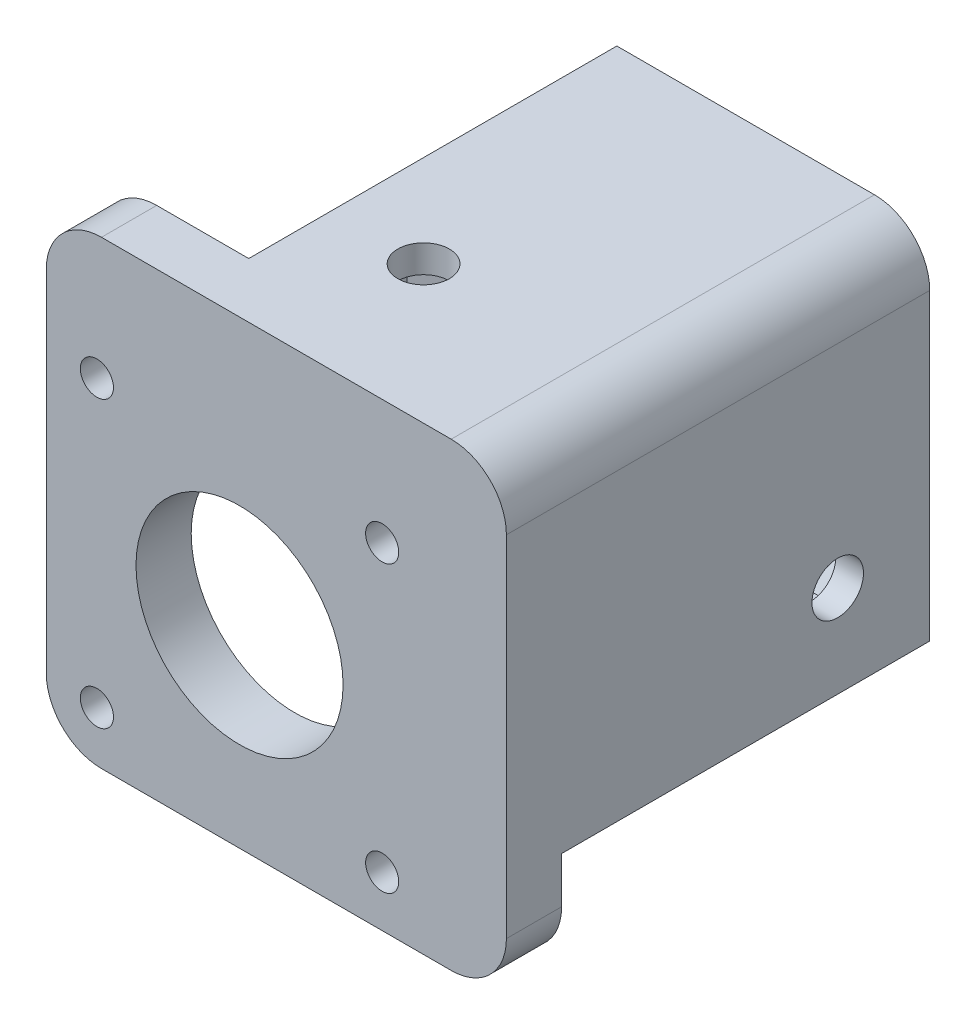
ISO-10303-21;
HEADER;
FILE_DESCRIPTION(('STEP AP214'),'2;1');
FILE_NAME('part.step','',(''),(''),'','','');
FILE_SCHEMA(('AUTOMOTIVE_DESIGN { 1 0 10303 214 1 1 1 1 }'));
ENDSEC;
DATA;
#1=APPLICATION_CONTEXT('core data for automotive mechanical design processes');
#2=APPLICATION_PROTOCOL_DEFINITION('international standard','automotive_design',2000,#1);
#3=PRODUCT_CONTEXT('',#1,'mechanical');
#4=PRODUCT('Part','Part','',(#3));
#5=PRODUCT_RELATED_PRODUCT_CATEGORY('part','',(#4));
#6=PRODUCT_DEFINITION_FORMATION('','',#4);
#7=PRODUCT_DEFINITION_CONTEXT('part definition',#1,'design');
#8=PRODUCT_DEFINITION('design','',#6,#7);
#9=PRODUCT_DEFINITION_SHAPE('','',#8);
#10=(LENGTH_UNIT() NAMED_UNIT(*) SI_UNIT(.MILLI.,.METRE.));
#11=(NAMED_UNIT(*) PLANE_ANGLE_UNIT() SI_UNIT($,.RADIAN.));
#12=(NAMED_UNIT(*) SI_UNIT($,.STERADIAN.) SOLID_ANGLE_UNIT());
#13=UNCERTAINTY_MEASURE_WITH_UNIT(LENGTH_MEASURE(1.E-05),#10,'distance_accuracy_value','');
#14=(GEOMETRIC_REPRESENTATION_CONTEXT(3) GLOBAL_UNCERTAINTY_ASSIGNED_CONTEXT((#13)) GLOBAL_UNIT_ASSIGNED_CONTEXT((#10,
#11,#12)) REPRESENTATION_CONTEXT('',''));
#15=CARTESIAN_POINT('',(0.,0.,0.));
#16=DIRECTION('',(0.,0.,1.));
#17=DIRECTION('',(1.,0.,0.));
#18=AXIS2_PLACEMENT_3D('',#15,#16,#17);
#19=CARTESIAN_POINT('',(0.,0.,0.));
#20=DIRECTION('',(0.,1.,0.));
#21=DIRECTION('',(0.,0.,1.));
#22=AXIS2_PLACEMENT_3D('',#19,#20,#21);
#23=PLANE('',#22);
#24=CARTESIAN_POINT('',(-24.,0.,-15.));
#25=DIRECTION('',(0.,1.,0.));
#26=DIRECTION('',(0.,0.,1.));
#27=AXIS2_PLACEMENT_3D('',#24,#25,#26);
#28=CIRCLE('',#27,2.79999999999999);
#29=CARTESIAN_POINT('',(-24.,0.,-12.2));
#30=VERTEX_POINT('',#29);
#31=EDGE_CURVE('E177',#30,#30,#28,.F.);
#32=ORIENTED_EDGE('',*,*,#31,.T.);
#33=EDGE_LOOP('',(#32));
#34=FACE_BOUND('',#33,.T.);
#35=DIRECTION('',(0.,0.,1.));
#36=VECTOR('',#35,1.);
#37=CARTESIAN_POINT('',(-44.,0.,-6.));
#38=LINE('',#37,#36);
#39=CARTESIAN_POINT('',(-44.,0.,0.));
#40=VERTEX_POINT('',#39);
#41=CARTESIAN_POINT('',(-44.,0.,-6.));
#42=VERTEX_POINT('',#41);
#43=EDGE_CURVE('E163',#40,#42,#38,.F.);
#44=ORIENTED_EDGE('',*,*,#43,.F.);
#45=DIRECTION('',(-1.,0.,0.));
#46=VECTOR('',#45,1.);
#47=CARTESIAN_POINT('',(0.,0.,0.));
#48=LINE('',#47,#46);
#49=CARTESIAN_POINT('',(-6.,0.,0.));
#50=VERTEX_POINT('',#49);
#51=EDGE_CURVE('E173',#50,#40,#48,.T.);
#52=ORIENTED_EDGE('',*,*,#51,.F.);
#53=DIRECTION('',(0.,0.,1.));
#54=VECTOR('',#53,1.);
#55=CARTESIAN_POINT('',(-6.,0.,-6.));
#56=LINE('',#55,#54);
#57=CARTESIAN_POINT('',(-6.,0.,-46.));
#58=VERTEX_POINT('',#57);
#59=EDGE_CURVE('E158',#58,#50,#56,.T.);
#60=ORIENTED_EDGE('',*,*,#59,.F.);
#61=DIRECTION('',(1.,0.,0.));
#62=VECTOR('',#61,1.);
#63=CARTESIAN_POINT('',(0.,0.,-46.));
#64=LINE('',#63,#62);
#65=CARTESIAN_POINT('',(-34.,0.,-46.));
#66=VERTEX_POINT('',#65);
#67=EDGE_CURVE('E168',#66,#58,#64,.T.);
#68=ORIENTED_EDGE('',*,*,#67,.F.);
#69=DIRECTION('',(0.,0.,1.));
#70=VECTOR('',#69,1.);
#71=CARTESIAN_POINT('',(-34.,0.,-46.));
#72=LINE('',#71,#70);
#73=CARTESIAN_POINT('',(-34.,0.,-6.));
#74=VERTEX_POINT('',#73);
#75=EDGE_CURVE('E185',#66,#74,#72,.T.);
#76=ORIENTED_EDGE('',*,*,#75,.T.);
#77=DIRECTION('',(-1.,0.,0.));
#78=VECTOR('',#77,1.);
#79=CARTESIAN_POINT('',(0.,0.,-6.));
#80=LINE('',#79,#78);
#81=EDGE_CURVE('E181',#74,#42,#80,.T.);
#82=ORIENTED_EDGE('',*,*,#81,.T.);
#83=EDGE_LOOP('',(#44,#52,#60,#68,#76,#82));
#84=FACE_BOUND('',#83,.T.);
#85=ADVANCED_FACE('F40',(#34,#84),#23,.T.);
#86=CARTESIAN_POINT('',(-3.,0.,0.));
#87=DIRECTION('',(-1.,0.,0.));
#88=DIRECTION('',(0.,0.,1.));
#89=AXIS2_PLACEMENT_3D('',#86,#87,#88);
#90=PLANE('',#89);
#91=DIRECTION('',(0.,0.866025403784439,-0.5));
#92=VECTOR('',#91,1.);
#93=CARTESIAN_POINT('',(-3.,-33.2,-38.4248711305964));
#94=LINE('',#93,#92);
#95=CARTESIAN_POINT('',(-3.,-33.2,-38.4248711305964));
#96=VERTEX_POINT('',#95);
#97=CARTESIAN_POINT('',(-3.,-29.,-40.8497422611929));
#98=VERTEX_POINT('',#97);
#99=EDGE_CURVE('E134',#96,#98,#94,.T.);
#100=ORIENTED_EDGE('',*,*,#99,.F.);
#101=DIRECTION('',(0.,0.,-1.));
#102=VECTOR('',#101,1.);
#103=CARTESIAN_POINT('',(-3.,-33.2,-33.5751288694036));
#104=LINE('',#103,#102);
#105=CARTESIAN_POINT('',(-3.,-33.2,-33.5751288694036));
#106=VERTEX_POINT('',#105);
#107=EDGE_CURVE('E88',#106,#96,#104,.T.);
#108=ORIENTED_EDGE('',*,*,#107,.F.);
#109=DIRECTION('',(0.,-0.866025403784438,-0.500000000000001));
#110=VECTOR('',#109,1.);
#111=CARTESIAN_POINT('',(-3.,-29.,-31.1502577388071));
#112=LINE('',#111,#110);
#113=CARTESIAN_POINT('',(-3.,-29.,-31.1502577388071));
#114=VERTEX_POINT('',#113);
#115=EDGE_CURVE('E82',#114,#106,#112,.T.);
#116=ORIENTED_EDGE('',*,*,#115,.F.);
#117=DIRECTION('',(0.,-0.866025403784439,0.5));
#118=VECTOR('',#117,1.);
#119=CARTESIAN_POINT('',(-3.,-24.8,-33.5751288694036));
#120=LINE('',#119,#118);
#121=CARTESIAN_POINT('',(-3.,-24.8,-33.5751288694036));
#122=VERTEX_POINT('',#121);
#123=EDGE_CURVE('E148',#122,#114,#120,.T.);
#124=ORIENTED_EDGE('',*,*,#123,.F.);
#125=DIRECTION('',(0.,0.,1.));
#126=VECTOR('',#125,1.);
#127=CARTESIAN_POINT('',(-3.,-24.8,-38.4248711305964));
#128=LINE('',#127,#126);
#129=CARTESIAN_POINT('',(-3.,-24.8,-38.4248711305964));
#130=VERTEX_POINT('',#129);
#131=EDGE_CURVE('E114',#130,#122,#128,.T.);
#132=ORIENTED_EDGE('',*,*,#131,.F.);
#133=DIRECTION('',(0.,0.866025403784438,0.500000000000001));
#134=VECTOR('',#133,1.);
#135=CARTESIAN_POINT('',(-3.,-29.,-40.8497422611929));
#136=LINE('',#135,#134);
#137=EDGE_CURVE('E142',#98,#130,#136,.T.);
#138=ORIENTED_EDGE('',*,*,#137,.F.);
#139=EDGE_LOOP('',(#100,#108,#116,#124,#132,#138));
#140=FACE_BOUND('',#139,.T.);
#141=CARTESIAN_POINT('',(-3.,-29.,-36.));
#142=DIRECTION('',(-1.,0.,0.));
#143=DIRECTION('',(0.,0.,1.));
#144=AXIS2_PLACEMENT_3D('',#141,#142,#143);
#145=CIRCLE('',#144,2.79999999999999);
#146=CARTESIAN_POINT('',(-3.,-29.,-33.2));
#147=VERTEX_POINT('',#146);
#148=EDGE_CURVE('E362',#147,#147,#145,.F.);
#149=ORIENTED_EDGE('',*,*,#148,.T.);
#150=EDGE_LOOP('',(#149));
#151=FACE_BOUND('',#150,.T.);
#152=ADVANCED_FACE('F603',(#140,#151),#90,.T.);
#153=CARTESIAN_POINT('',(-19.8,-3.,-17.4248711305964));
#154=DIRECTION('',(-0.500000000000001,0.,0.866025403784438));
#155=DIRECTION('',(0.866025403784438,0.,0.500000000000001));
#156=AXIS2_PLACEMENT_3D('',#153,#154,#155);
#157=PLANE('',#156);
#158=DIRECTION('',(-0.866025403784438,0.,-0.500000000000001));
#159=VECTOR('',#158,1.);
#160=CARTESIAN_POINT('',(-19.8,-6.,-17.4248711305964));
#161=LINE('',#160,#159);
#162=CARTESIAN_POINT('',(-19.8,-6.,-17.4248711305964));
#163=VERTEX_POINT('',#162);
#164=CARTESIAN_POINT('',(-24.,-6.,-19.8497422611929));
#165=VERTEX_POINT('',#164);
#166=EDGE_CURVE('E350',#163,#165,#161,.T.);
#167=ORIENTED_EDGE('',*,*,#166,.F.);
#168=DIRECTION('',(0.,-1.,0.));
#169=VECTOR('',#168,1.);
#170=CARTESIAN_POINT('',(-19.8,-3.,-17.4248711305964));
#171=LINE('',#170,#169);
#172=CARTESIAN_POINT('',(-19.8,-3.,-17.4248711305964));
#173=VERTEX_POINT('',#172);
#174=EDGE_CURVE('E321',#173,#163,#171,.T.);
#175=ORIENTED_EDGE('',*,*,#174,.F.);
#176=DIRECTION('',(-0.866025403784438,0.,-0.500000000000001));
#177=VECTOR('',#176,1.);
#178=CARTESIAN_POINT('',(-19.8,-3.,-17.4248711305964));
#179=LINE('',#178,#177);
#180=CARTESIAN_POINT('',(-24.,-3.,-19.8497422611929));
#181=VERTEX_POINT('',#180);
#182=EDGE_CURVE('E374',#173,#181,#179,.T.);
#183=ORIENTED_EDGE('',*,*,#182,.T.);
#184=DIRECTION('',(0.,-1.,0.));
#185=VECTOR('',#184,1.);
#186=CARTESIAN_POINT('',(-24.,-3.,-19.8497422611929));
#187=LINE('',#186,#185);
#188=EDGE_CURVE('E317',#181,#165,#187,.T.);
#189=ORIENTED_EDGE('',*,*,#188,.T.);
#190=EDGE_LOOP('',(#167,#175,#183,#189));
#191=FACE_BOUND('',#190,.T.);
#192=ADVANCED_FACE('F593',(#191),#157,.T.);
#193=CARTESIAN_POINT('',(-19.8,-3.,-12.5751288694036));
#194=DIRECTION('',(-1.,0.,0.));
#195=DIRECTION('',(0.,0.,1.));
#196=AXIS2_PLACEMENT_3D('',#193,#194,#195);
#197=PLANE('',#196);
#198=DIRECTION('',(0.,0.,-1.));
#199=VECTOR('',#198,1.);
#200=CARTESIAN_POINT('',(-19.8,-6.,-12.5751288694036));
#201=LINE('',#200,#199);
#202=CARTESIAN_POINT('',(-19.8,-6.,-12.5751288694036));
#203=VERTEX_POINT('',#202);
#204=EDGE_CURVE('E346',#203,#163,#201,.T.);
#205=ORIENTED_EDGE('',*,*,#204,.F.);
#206=DIRECTION('',(0.,-1.,0.));
#207=VECTOR('',#206,1.);
#208=CARTESIAN_POINT('',(-19.8,-3.,-12.5751288694036));
#209=LINE('',#208,#207);
#210=CARTESIAN_POINT('',(-19.8,-3.,-12.5751288694036));
#211=VERTEX_POINT('',#210);
#212=EDGE_CURVE('E325',#211,#203,#209,.T.);
#213=ORIENTED_EDGE('',*,*,#212,.F.);
#214=DIRECTION('',(0.,0.,-1.));
#215=VECTOR('',#214,1.);
#216=CARTESIAN_POINT('',(-19.8,-3.,-12.5751288694036));
#217=LINE('',#216,#215);
#218=EDGE_CURVE('E370',#211,#173,#217,.T.);
#219=ORIENTED_EDGE('',*,*,#218,.T.);
#220=ORIENTED_EDGE('',*,*,#174,.T.);
#221=EDGE_LOOP('',(#205,#213,#219,#220));
#222=FACE_BOUND('',#221,.T.);
#223=ADVANCED_FACE('F595',(#222),#197,.T.);
#224=CARTESIAN_POINT('',(-24.,-3.,-10.1502577388071));
#225=DIRECTION('',(-0.500000000000001,0.,-0.866025403784438));
#226=DIRECTION('',(-0.866025403784438,0.,0.500000000000001));
#227=AXIS2_PLACEMENT_3D('',#224,#225,#226);
#228=PLANE('',#227);
#229=DIRECTION('',(0.866025403784438,0.,-0.500000000000001));
#230=VECTOR('',#229,1.);
#231=CARTESIAN_POINT('',(-24.,-6.,-10.1502577388071));
#232=LINE('',#231,#230);
#233=CARTESIAN_POINT('',(-24.,-6.,-10.1502577388071));
#234=VERTEX_POINT('',#233);
#235=EDGE_CURVE('E341',#234,#203,#232,.T.);
#236=ORIENTED_EDGE('',*,*,#235,.F.);
#237=DIRECTION('',(0.,-1.,0.));
#238=VECTOR('',#237,1.);
#239=CARTESIAN_POINT('',(-24.,-3.,-10.1502577388071));
#240=LINE('',#239,#238);
#241=CARTESIAN_POINT('',(-24.,-3.,-10.1502577388071));
#242=VERTEX_POINT('',#241);
#243=EDGE_CURVE('E329',#242,#234,#240,.T.);
#244=ORIENTED_EDGE('',*,*,#243,.F.);
#245=DIRECTION('',(0.866025403784438,0.,-0.500000000000001));
#246=VECTOR('',#245,1.);
#247=CARTESIAN_POINT('',(-24.,-3.,-10.1502577388071));
#248=LINE('',#247,#246);
#249=EDGE_CURVE('E366',#242,#211,#248,.T.);
#250=ORIENTED_EDGE('',*,*,#249,.T.);
#251=ORIENTED_EDGE('',*,*,#212,.T.);
#252=EDGE_LOOP('',(#236,#244,#250,#251));
#253=FACE_BOUND('',#252,.T.);
#254=ADVANCED_FACE('F587',(#253),#228,.T.);
#255=CARTESIAN_POINT('',(-28.2,-3.,-12.5751288694036));
#256=DIRECTION('',(0.5,0.,-0.866025403784439));
#257=DIRECTION('',(-0.866025403784439,0.,-0.5));
#258=AXIS2_PLACEMENT_3D('',#255,#256,#257);
#259=PLANE('',#258);
#260=DIRECTION('',(0.866025403784439,0.,0.499999999999999));
#261=VECTOR('',#260,1.);
#262=CARTESIAN_POINT('',(-28.2,-6.,-12.5751288694036));
#263=LINE('',#262,#261);
#264=CARTESIAN_POINT('',(-28.2,-6.,-12.5751288694036));
#265=VERTEX_POINT('',#264);
#266=EDGE_CURVE('E337',#265,#234,#263,.T.);
#267=ORIENTED_EDGE('',*,*,#266,.F.);
#268=DIRECTION('',(0.,-1.,0.));
#269=VECTOR('',#268,1.);
#270=CARTESIAN_POINT('',(-28.2,-3.,-12.5751288694036));
#271=LINE('',#270,#269);
#272=CARTESIAN_POINT('',(-28.2,-3.,-12.5751288694036));
#273=VERTEX_POINT('',#272);
#274=EDGE_CURVE('E333',#273,#265,#271,.T.);
#275=ORIENTED_EDGE('',*,*,#274,.F.);
#276=DIRECTION('',(0.866025403784439,0.,0.499999999999999));
#277=VECTOR('',#276,1.);
#278=CARTESIAN_POINT('',(-28.2,-3.,-12.5751288694036));
#279=LINE('',#278,#277);
#280=EDGE_CURVE('E316',#273,#242,#279,.T.);
#281=ORIENTED_EDGE('',*,*,#280,.T.);
#282=ORIENTED_EDGE('',*,*,#243,.T.);
#283=EDGE_LOOP('',(#267,#275,#281,#282));
#284=FACE_BOUND('',#283,.T.);
#285=ADVANCED_FACE('F584',(#284),#259,.T.);
#286=CARTESIAN_POINT('',(-28.2,-3.,-17.4248711305964));
#287=DIRECTION('',(1.,0.,0.));
#288=DIRECTION('',(0.,1.,0.));
#289=AXIS2_PLACEMENT_3D('',#286,#287,#288);
#290=PLANE('',#289);
#291=DIRECTION('',(0.,0.,1.));
#292=VECTOR('',#291,1.);
#293=CARTESIAN_POINT('',(-28.2,-6.,-17.4248711305964));
#294=LINE('',#293,#292);
#295=CARTESIAN_POINT('',(-28.2,-6.,-17.4248711305964));
#296=VERTEX_POINT('',#295);
#297=EDGE_CURVE('E358',#296,#265,#294,.T.);
#298=ORIENTED_EDGE('',*,*,#297,.F.);
#299=DIRECTION('',(0.,-1.,0.));
#300=VECTOR('',#299,1.);
#301=CARTESIAN_POINT('',(-28.2,-3.,-17.4248711305964));
#302=LINE('',#301,#300);
#303=CARTESIAN_POINT('',(-28.2,-3.,-17.4248711305964));
#304=VERTEX_POINT('',#303);
#305=EDGE_CURVE('E312',#304,#296,#302,.T.);
#306=ORIENTED_EDGE('',*,*,#305,.F.);
#307=DIRECTION('',(0.,0.,1.));
#308=VECTOR('',#307,1.);
#309=CARTESIAN_POINT('',(-28.2,-3.,-17.4248711305964));
#310=LINE('',#309,#308);
#311=EDGE_CURVE('E342',#304,#273,#310,.T.);
#312=ORIENTED_EDGE('',*,*,#311,.T.);
#313=ORIENTED_EDGE('',*,*,#274,.T.);
#314=EDGE_LOOP('',(#298,#306,#312,#313));
#315=FACE_BOUND('',#314,.T.);
#316=ADVANCED_FACE('F576',(#315),#290,.T.);
#317=CARTESIAN_POINT('',(-24.,-3.,-19.8497422611929));
#318=DIRECTION('',(0.5,0.,0.866025403784439));
#319=DIRECTION('',(0.866025403784439,0.,-0.5));
#320=AXIS2_PLACEMENT_3D('',#317,#318,#319);
#321=PLANE('',#320);
#322=DIRECTION('',(-0.866025403784439,0.,0.499999999999999));
#323=VECTOR('',#322,1.);
#324=CARTESIAN_POINT('',(-24.,-6.,-19.8497422611929));
#325=LINE('',#324,#323);
#326=EDGE_CURVE('E354',#165,#296,#325,.T.);
#327=ORIENTED_EDGE('',*,*,#326,.F.);
#328=ORIENTED_EDGE('',*,*,#188,.F.);
#329=DIRECTION('',(-0.866025403784439,0.,0.499999999999999));
#330=VECTOR('',#329,1.);
#331=CARTESIAN_POINT('',(-24.,-3.,-19.8497422611929));
#332=LINE('',#331,#330);
#333=EDGE_CURVE('E378',#181,#304,#332,.T.);
#334=ORIENTED_EDGE('',*,*,#333,.T.);
#335=ORIENTED_EDGE('',*,*,#305,.T.);
#336=EDGE_LOOP('',(#327,#328,#334,#335));
#337=FACE_BOUND('',#336,.T.);
#338=ADVANCED_FACE('F572',(#337),#321,.T.);
#339=CARTESIAN_POINT('',(-3.,-29.,-31.1502577388071));
#340=DIRECTION('',(0.,0.500000000000001,-0.866025403784438));
#341=DIRECTION('',(0.,0.866025403784438,0.500000000000001));
#342=AXIS2_PLACEMENT_3D('',#339,#340,#341);
#343=PLANE('',#342);
#344=DIRECTION('',(0.,-0.866025403784438,-0.500000000000001));
#345=VECTOR('',#344,1.);
#346=CARTESIAN_POINT('',(-6.,-29.,-31.1502577388071));
#347=LINE('',#346,#345);
#348=CARTESIAN_POINT('',(-6.,-29.,-31.1502577388071));
#349=VERTEX_POINT('',#348);
#350=CARTESIAN_POINT('',(-6.,-33.2,-33.5751288694036));
#351=VERTEX_POINT('',#350);
#352=EDGE_CURVE('E127',#349,#351,#347,.T.);
#353=ORIENTED_EDGE('',*,*,#352,.F.);
#354=DIRECTION('',(-1.,0.,0.));
#355=VECTOR('',#354,1.);
#356=CARTESIAN_POINT('',(-3.,-29.,-31.1502577388071));
#357=LINE('',#356,#355);
#358=EDGE_CURVE('E118',#114,#349,#357,.T.);
#359=ORIENTED_EDGE('',*,*,#358,.F.);
#360=ORIENTED_EDGE('',*,*,#115,.T.);
#361=DIRECTION('',(-1.,0.,0.));
#362=VECTOR('',#361,1.);
#363=CARTESIAN_POINT('',(-3.,-33.2,-33.5751288694036));
#364=LINE('',#363,#362);
#365=EDGE_CURVE('E60',#106,#351,#364,.T.);
#366=ORIENTED_EDGE('',*,*,#365,.T.);
#367=EDGE_LOOP('',(#353,#359,#360,#366));
#368=FACE_BOUND('',#367,.T.);
#369=ADVANCED_FACE('F697',(#368),#343,.T.);
#370=CARTESIAN_POINT('',(-3.,-24.8,-33.5751288694036));
#371=DIRECTION('',(0.,-0.5,-0.866025403784439));
#372=DIRECTION('',(0.,0.866025403784439,-0.5));
#373=AXIS2_PLACEMENT_3D('',#370,#371,#372);
#374=PLANE('',#373);
#375=DIRECTION('',(0.,-0.866025403784439,0.5));
#376=VECTOR('',#375,1.);
#377=CARTESIAN_POINT('',(-6.,-24.8,-33.5751288694036));
#378=LINE('',#377,#376);
#379=CARTESIAN_POINT('',(-6.,-24.8,-33.5751288694036));
#380=VERTEX_POINT('',#379);
#381=EDGE_CURVE('E122',#380,#349,#378,.T.);
#382=ORIENTED_EDGE('',*,*,#381,.F.);
#383=DIRECTION('',(-1.,0.,0.));
#384=VECTOR('',#383,1.);
#385=CARTESIAN_POINT('',(-3.,-24.8,-33.5751288694036));
#386=LINE('',#385,#384);
#387=EDGE_CURVE('E107',#122,#380,#386,.T.);
#388=ORIENTED_EDGE('',*,*,#387,.F.);
#389=ORIENTED_EDGE('',*,*,#123,.T.);
#390=ORIENTED_EDGE('',*,*,#358,.T.);
#391=EDGE_LOOP('',(#382,#388,#389,#390));
#392=FACE_BOUND('',#391,.T.);
#393=ADVANCED_FACE('F123',(#392),#374,.T.);
#394=CARTESIAN_POINT('',(-3.,-24.8,-38.4248711305964));
#395=DIRECTION('',(0.,-1.,0.));
#396=DIRECTION('',(0.,0.,-1.));
#397=AXIS2_PLACEMENT_3D('',#394,#395,#396);
#398=PLANE('',#397);
#399=DIRECTION('',(0.,0.,1.));
#400=VECTOR('',#399,1.);
#401=CARTESIAN_POINT('',(-6.,-24.8,-38.4248711305964));
#402=LINE('',#401,#400);
#403=CARTESIAN_POINT('',(-6.,-24.8,-38.4248711305964));
#404=VERTEX_POINT('',#403);
#405=EDGE_CURVE('E112',#404,#380,#402,.T.);
#406=ORIENTED_EDGE('',*,*,#405,.F.);
#407=DIRECTION('',(-1.,0.,0.));
#408=VECTOR('',#407,1.);
#409=CARTESIAN_POINT('',(-3.,-24.8,-38.4248711305964));
#410=LINE('',#409,#408);
#411=EDGE_CURVE('E119',#130,#404,#410,.T.);
#412=ORIENTED_EDGE('',*,*,#411,.F.);
#413=ORIENTED_EDGE('',*,*,#131,.T.);
#414=ORIENTED_EDGE('',*,*,#387,.T.);
#415=EDGE_LOOP('',(#406,#412,#413,#414));
#416=FACE_BOUND('',#415,.T.);
#417=ADVANCED_FACE('F109',(#416),#398,.T.);
#418=CARTESIAN_POINT('',(-3.,-29.,-40.8497422611929));
#419=DIRECTION('',(0.,-0.500000000000001,0.866025403784438));
#420=DIRECTION('',(0.,-0.866025403784438,-0.500000000000001));
#421=AXIS2_PLACEMENT_3D('',#418,#419,#420);
#422=PLANE('',#421);
#423=DIRECTION('',(0.,0.866025403784438,0.500000000000001));
#424=VECTOR('',#423,1.);
#425=CARTESIAN_POINT('',(-6.,-29.,-40.8497422611929));
#426=LINE('',#425,#424);
#427=CARTESIAN_POINT('',(-6.,-29.,-40.8497422611929));
#428=VERTEX_POINT('',#427);
#429=EDGE_CURVE('E97',#428,#404,#426,.T.);
#430=ORIENTED_EDGE('',*,*,#429,.F.);
#431=DIRECTION('',(-1.,0.,0.));
#432=VECTOR('',#431,1.);
#433=CARTESIAN_POINT('',(-3.,-29.,-40.8497422611929));
#434=LINE('',#433,#432);
#435=EDGE_CURVE('E392',#98,#428,#434,.T.);
#436=ORIENTED_EDGE('',*,*,#435,.F.);
#437=ORIENTED_EDGE('',*,*,#137,.T.);
#438=ORIENTED_EDGE('',*,*,#411,.T.);
#439=EDGE_LOOP('',(#430,#436,#437,#438));
#440=FACE_BOUND('',#439,.T.);
#441=ADVANCED_FACE('F616',(#440),#422,.T.);
#442=CARTESIAN_POINT('',(-3.,-33.2,-38.4248711305964));
#443=DIRECTION('',(0.,0.5,0.866025403784439));
#444=DIRECTION('',(0.,-0.866025403784439,0.5));
#445=AXIS2_PLACEMENT_3D('',#442,#443,#444);
#446=PLANE('',#445);
#447=DIRECTION('',(0.,0.866025403784439,-0.5));
#448=VECTOR('',#447,1.);
#449=CARTESIAN_POINT('',(-6.,-33.2,-38.4248711305964));
#450=LINE('',#449,#448);
#451=CARTESIAN_POINT('',(-6.,-33.2,-38.4248711305964));
#452=VERTEX_POINT('',#451);
#453=EDGE_CURVE('E12',#452,#428,#450,.T.);
#454=ORIENTED_EDGE('',*,*,#453,.F.);
#455=DIRECTION('',(-1.,0.,0.));
#456=VECTOR('',#455,1.);
#457=CARTESIAN_POINT('',(-3.,-33.2,-38.4248711305964));
#458=LINE('',#457,#456);
#459=EDGE_CURVE('E145',#96,#452,#458,.T.);
#460=ORIENTED_EDGE('',*,*,#459,.F.);
#461=ORIENTED_EDGE('',*,*,#99,.T.);
#462=ORIENTED_EDGE('',*,*,#435,.T.);
#463=EDGE_LOOP('',(#454,#460,#461,#462));
#464=FACE_BOUND('',#463,.T.);
#465=ADVANCED_FACE('F712',(#464),#446,.T.);
#466=CARTESIAN_POINT('',(-3.,-33.2,-33.5751288694036));
#467=DIRECTION('',(0.,1.,0.));
#468=DIRECTION('',(0.,0.,1.));
#469=AXIS2_PLACEMENT_3D('',#466,#467,#468);
#470=PLANE('',#469);
#471=DIRECTION('',(0.,0.,-1.));
#472=VECTOR('',#471,1.);
#473=CARTESIAN_POINT('',(-6.,-33.2,-33.5751288694036));
#474=LINE('',#473,#472);
#475=EDGE_CURVE('E51',#351,#452,#474,.T.);
#476=ORIENTED_EDGE('',*,*,#475,.F.);
#477=ORIENTED_EDGE('',*,*,#365,.F.);
#478=ORIENTED_EDGE('',*,*,#107,.T.);
#479=ORIENTED_EDGE('',*,*,#459,.T.);
#480=EDGE_LOOP('',(#476,#477,#478,#479));
#481=FACE_BOUND('',#480,.T.);
#482=ADVANCED_FACE('F692',(#481),#470,.T.);
#483=CARTESIAN_POINT('',(0.,-29.,-36.));
#484=DIRECTION('',(1.,0.,0.));
#485=DIRECTION('',(0.,0.,-1.));
#486=AXIS2_PLACEMENT_3D('',#483,#484,#485);
#487=CYLINDRICAL_SURFACE('',#486,2.79999999999999);
#488=CARTESIAN_POINT('',(0.,-29.,-36.));
#489=DIRECTION('',(1.,0.,0.));
#490=DIRECTION('',(0.,0.,-1.));
#491=AXIS2_PLACEMENT_3D('',#488,#489,#490);
#492=CIRCLE('',#491,2.79999999999999);
#493=CARTESIAN_POINT('',(0.,-29.,-38.8));
#494=VERTEX_POINT('',#493);
#495=EDGE_CURVE('E307',#494,#494,#492,.T.);
#496=ORIENTED_EDGE('',*,*,#495,.T.);
#497=EDGE_LOOP('',(#496));
#498=FACE_BOUND('',#497,.T.);
#499=ORIENTED_EDGE('',*,*,#148,.F.);
#500=EDGE_LOOP('',(#499));
#501=FACE_BOUND('',#500,.T.);
#502=ADVANCED_FACE('F660',(#498,#501),#487,.F.);
#503=CARTESIAN_POINT('',(-6.,-44.,-6.));
#504=DIRECTION('',(0.,0.,1.));
#505=DIRECTION('',(1.,0.,0.));
#506=AXIS2_PLACEMENT_3D('',#503,#504,#505);
#507=CYLINDRICAL_SURFACE('',#506,6.);
#508=CARTESIAN_POINT('',(-6.,-44.,-6.));
#509=DIRECTION('',(0.,0.,1.));
#510=DIRECTION('',(1.,0.,0.));
#511=AXIS2_PLACEMENT_3D('',#508,#509,#510);
#512=CIRCLE('',#511,6.);
#513=CARTESIAN_POINT('',(0.,-44.,-6.));
#514=VERTEX_POINT('',#513);
#515=CARTESIAN_POINT('',(-6.,-50.,-6.));
#516=VERTEX_POINT('',#515);
#517=EDGE_CURVE('E447',#514,#516,#512,.F.);
#518=ORIENTED_EDGE('',*,*,#517,.F.);
#519=DIRECTION('',(0.,0.,1.));
#520=VECTOR('',#519,1.);
#521=CARTESIAN_POINT('',(0.,-44.,-6.));
#522=LINE('',#521,#520);
#523=CARTESIAN_POINT('',(0.,-44.,0.));
#524=VERTEX_POINT('',#523);
#525=EDGE_CURVE('E481',#524,#514,#522,.F.);
#526=ORIENTED_EDGE('',*,*,#525,.F.);
#527=CARTESIAN_POINT('',(-6.,-44.,0.));
#528=DIRECTION('',(0.,0.,1.));
#529=DIRECTION('',(1.,0.,0.));
#530=AXIS2_PLACEMENT_3D('',#527,#528,#529);
#531=CIRCLE('',#530,6.);
#532=CARTESIAN_POINT('',(-6.,-50.,0.));
#533=VERTEX_POINT('',#532);
#534=EDGE_CURVE('E167',#533,#524,#531,.T.);
#535=ORIENTED_EDGE('',*,*,#534,.F.);
#536=DIRECTION('',(0.,0.,1.));
#537=VECTOR('',#536,1.);
#538=CARTESIAN_POINT('',(-6.,-50.,-6.));
#539=LINE('',#538,#537);
#540=EDGE_CURVE('E490',#516,#533,#539,.T.);
#541=ORIENTED_EDGE('',*,*,#540,.F.);
#542=EDGE_LOOP('',(#518,#526,#535,#541));
#543=FACE_BOUND('',#542,.T.);
#544=ADVANCED_FACE('F484',(#543),#507,.T.);
#545=CARTESIAN_POINT('',(-50.,-50.,-6.));
#546=DIRECTION('',(0.,1.,0.));
#547=DIRECTION('',(0.,0.,1.));
#548=AXIS2_PLACEMENT_3D('',#545,#546,#547);
#549=PLANE('',#548);
#550=DIRECTION('',(-1.,0.,0.));
#551=VECTOR('',#550,1.);
#552=CARTESIAN_POINT('',(-50.,-50.,0.));
#553=LINE('',#552,#551);
#554=CARTESIAN_POINT('',(-44.,-50.,0.));
#555=VERTEX_POINT('',#554);
#556=EDGE_CURVE('E409',#533,#555,#553,.T.);
#557=ORIENTED_EDGE('',*,*,#556,.T.);
#558=DIRECTION('',(0.,0.,1.));
#559=VECTOR('',#558,1.);
#560=CARTESIAN_POINT('',(-44.,-50.,-6.));
#561=LINE('',#560,#559);
#562=CARTESIAN_POINT('',(-44.,-50.,-6.));
#563=VERTEX_POINT('',#562);
#564=EDGE_CURVE('E486',#555,#563,#561,.F.);
#565=ORIENTED_EDGE('',*,*,#564,.T.);
#566=DIRECTION('',(-1.,0.,0.));
#567=VECTOR('',#566,1.);
#568=CARTESIAN_POINT('',(-50.,-50.,-6.));
#569=LINE('',#568,#567);
#570=EDGE_CURVE('E205',#516,#563,#569,.T.);
#571=ORIENTED_EDGE('',*,*,#570,.F.);
#572=ORIENTED_EDGE('',*,*,#540,.T.);
#573=EDGE_LOOP('',(#557,#565,#571,#572));
#574=FACE_BOUND('',#573,.T.);
#575=ADVANCED_FACE('F651',(#574),#549,.F.);
#576=CARTESIAN_POINT('',(-44.,-44.,-6.));
#577=DIRECTION('',(0.,0.,1.));
#578=DIRECTION('',(1.,0.,0.));
#579=AXIS2_PLACEMENT_3D('',#576,#577,#578);
#580=CYLINDRICAL_SURFACE('',#579,6.);
#581=CARTESIAN_POINT('',(-44.,-44.,-6.));
#582=DIRECTION('',(0.,0.,1.));
#583=DIRECTION('',(1.,0.,0.));
#584=AXIS2_PLACEMENT_3D('',#581,#582,#583);
#585=CIRCLE('',#584,6.);
#586=CARTESIAN_POINT('',(-50.,-44.,-6.));
#587=VERTEX_POINT('',#586);
#588=EDGE_CURVE('E452',#563,#587,#585,.F.);
#589=ORIENTED_EDGE('',*,*,#588,.F.);
#590=ORIENTED_EDGE('',*,*,#564,.F.);
#591=CARTESIAN_POINT('',(-44.,-44.,0.));
#592=DIRECTION('',(0.,0.,1.));
#593=DIRECTION('',(1.,0.,0.));
#594=AXIS2_PLACEMENT_3D('',#591,#592,#593);
#595=CIRCLE('',#594,6.);
#596=CARTESIAN_POINT('',(-50.,-44.,0.));
#597=VERTEX_POINT('',#596);
#598=EDGE_CURVE('E458',#597,#555,#595,.T.);
#599=ORIENTED_EDGE('',*,*,#598,.F.);
#600=DIRECTION('',(0.,0.,1.));
#601=VECTOR('',#600,1.);
#602=CARTESIAN_POINT('',(-50.,-44.,-6.));
#603=LINE('',#602,#601);
#604=EDGE_CURVE('E432',#587,#597,#603,.T.);
#605=ORIENTED_EDGE('',*,*,#604,.F.);
#606=EDGE_LOOP('',(#589,#590,#599,#605));
#607=FACE_BOUND('',#606,.T.);
#608=ADVANCED_FACE('F507',(#607),#580,.T.);
#609=CARTESIAN_POINT('',(-29.,-29.,0.));
#610=DIRECTION('',(0.,0.,1.));
#611=DIRECTION('',(1.,0.,0.));
#612=AXIS2_PLACEMENT_3D('',#609,#610,#611);
#613=CYLINDRICAL_SURFACE('',#612,11.25);
#614=CARTESIAN_POINT('',(-29.,-29.,0.));
#615=DIRECTION('',(0.,0.,1.));
#616=DIRECTION('',(1.,0.,0.));
#617=AXIS2_PLACEMENT_3D('',#614,#615,#616);
#618=CIRCLE('',#617,11.25);
#619=CARTESIAN_POINT('',(-17.75,-29.,0.));
#620=VERTEX_POINT('',#619);
#621=EDGE_CURVE('E303',#620,#620,#618,.T.);
#622=ORIENTED_EDGE('',*,*,#621,.T.);
#623=EDGE_LOOP('',(#622));
#624=FACE_BOUND('',#623,.T.);
#625=CARTESIAN_POINT('',(-29.,-29.,-6.));
#626=DIRECTION('',(0.,0.,1.));
#627=DIRECTION('',(1.,0.,0.));
#628=AXIS2_PLACEMENT_3D('',#625,#626,#627);
#629=CIRCLE('',#628,11.25);
#630=CARTESIAN_POINT('',(-17.75,-29.,-6.));
#631=VERTEX_POINT('',#630);
#632=EDGE_CURVE('E299',#631,#631,#629,.T.);
#633=ORIENTED_EDGE('',*,*,#632,.F.);
#634=EDGE_LOOP('',(#633));
#635=FACE_BOUND('',#634,.T.);
#636=ADVANCED_FACE('F658',(#624,#635),#613,.F.);
#637=CARTESIAN_POINT('',(-44.5,-44.5,0.));
#638=DIRECTION('',(0.,0.,1.));
#639=DIRECTION('',(1.,0.,0.));
#640=AXIS2_PLACEMENT_3D('',#637,#638,#639);
#641=CYLINDRICAL_SURFACE('',#640,1.8);
#642=CARTESIAN_POINT('',(-44.5,-44.5,0.));
#643=DIRECTION('',(0.,0.,1.));
#644=DIRECTION('',(1.,0.,0.));
#645=AXIS2_PLACEMENT_3D('',#642,#643,#644);
#646=CIRCLE('',#645,1.8);
#647=CARTESIAN_POINT('',(-42.7,-44.5,0.));
#648=VERTEX_POINT('',#647);
#649=EDGE_CURVE('E295',#648,#648,#646,.T.);
#650=ORIENTED_EDGE('',*,*,#649,.T.);
#651=EDGE_LOOP('',(#650));
#652=FACE_BOUND('',#651,.T.);
#653=CARTESIAN_POINT('',(-44.5,-44.5,-6.));
#654=DIRECTION('',(0.,0.,1.));
#655=DIRECTION('',(1.,0.,0.));
#656=AXIS2_PLACEMENT_3D('',#653,#654,#655);
#657=CIRCLE('',#656,1.8);
#658=CARTESIAN_POINT('',(-42.7,-44.5,-6.));
#659=VERTEX_POINT('',#658);
#660=EDGE_CURVE('E291',#659,#659,#657,.T.);
#661=ORIENTED_EDGE('',*,*,#660,.F.);
#662=EDGE_LOOP('',(#661));
#663=FACE_BOUND('',#662,.T.);
#664=ADVANCED_FACE('F682',(#652,#663),#641,.F.);
#665=CARTESIAN_POINT('',(-13.5,-44.5,0.));
#666=DIRECTION('',(0.,0.,1.));
#667=DIRECTION('',(1.,0.,0.));
#668=AXIS2_PLACEMENT_3D('',#665,#666,#667);
#669=CYLINDRICAL_SURFACE('',#668,1.8);
#670=CARTESIAN_POINT('',(-13.5,-44.5,0.));
#671=DIRECTION('',(0.,0.,1.));
#672=DIRECTION('',(1.,0.,0.));
#673=AXIS2_PLACEMENT_3D('',#670,#671,#672);
#674=CIRCLE('',#673,1.8);
#675=CARTESIAN_POINT('',(-11.7,-44.5,0.));
#676=VERTEX_POINT('',#675);
#677=EDGE_CURVE('E287',#676,#676,#674,.T.);
#678=ORIENTED_EDGE('',*,*,#677,.T.);
#679=EDGE_LOOP('',(#678));
#680=FACE_BOUND('',#679,.T.);
#681=CARTESIAN_POINT('',(-13.5,-44.5,-6.));
#682=DIRECTION('',(0.,0.,1.));
#683=DIRECTION('',(1.,0.,0.));
#684=AXIS2_PLACEMENT_3D('',#681,#682,#683);
#685=CIRCLE('',#684,1.8);
#686=CARTESIAN_POINT('',(-11.7,-44.5,-6.));
#687=VERTEX_POINT('',#686);
#688=EDGE_CURVE('E283',#687,#687,#685,.T.);
#689=ORIENTED_EDGE('',*,*,#688,.F.);
#690=EDGE_LOOP('',(#689));
#691=FACE_BOUND('',#690,.T.);
#692=ADVANCED_FACE('F678',(#680,#691),#669,.F.);
#693=CARTESIAN_POINT('',(-13.5,-13.5,0.));
#694=DIRECTION('',(0.,0.,1.));
#695=DIRECTION('',(1.,0.,0.));
#696=AXIS2_PLACEMENT_3D('',#693,#694,#695);
#697=CYLINDRICAL_SURFACE('',#696,1.8);
#698=CARTESIAN_POINT('',(-13.5,-13.5,0.));
#699=DIRECTION('',(0.,0.,1.));
#700=DIRECTION('',(1.,0.,0.));
#701=AXIS2_PLACEMENT_3D('',#698,#699,#700);
#702=CIRCLE('',#701,1.8);
#703=CARTESIAN_POINT('',(-11.7,-13.5,0.));
#704=VERTEX_POINT('',#703);
#705=EDGE_CURVE('E279',#704,#704,#702,.T.);
#706=ORIENTED_EDGE('',*,*,#705,.T.);
#707=EDGE_LOOP('',(#706));
#708=FACE_BOUND('',#707,.T.);
#709=CARTESIAN_POINT('',(-13.5,-13.5,-6.));
#710=DIRECTION('',(0.,0.,1.));
#711=DIRECTION('',(1.,0.,0.));
#712=AXIS2_PLACEMENT_3D('',#709,#710,#711);
#713=CIRCLE('',#712,1.8);
#714=CARTESIAN_POINT('',(-11.7,-13.5,-6.));
#715=VERTEX_POINT('',#714);
#716=EDGE_CURVE('E275',#715,#715,#713,.T.);
#717=ORIENTED_EDGE('',*,*,#716,.F.);
#718=EDGE_LOOP('',(#717));
#719=FACE_BOUND('',#718,.T.);
#720=ADVANCED_FACE('F674',(#708,#719),#697,.F.);
#721=CARTESIAN_POINT('',(-44.5,-13.5,0.));
#722=DIRECTION('',(0.,0.,1.));
#723=DIRECTION('',(1.,0.,0.));
#724=AXIS2_PLACEMENT_3D('',#721,#722,#723);
#725=CYLINDRICAL_SURFACE('',#724,1.8);
#726=CARTESIAN_POINT('',(-44.5,-13.5,0.));
#727=DIRECTION('',(0.,0.,1.));
#728=DIRECTION('',(1.,0.,0.));
#729=AXIS2_PLACEMENT_3D('',#726,#727,#728);
#730=CIRCLE('',#729,1.8);
#731=CARTESIAN_POINT('',(-42.7,-13.5,0.));
#732=VERTEX_POINT('',#731);
#733=EDGE_CURVE('E271',#732,#732,#730,.T.);
#734=ORIENTED_EDGE('',*,*,#733,.T.);
#735=EDGE_LOOP('',(#734));
#736=FACE_BOUND('',#735,.T.);
#737=CARTESIAN_POINT('',(-44.5,-13.5,-6.));
#738=DIRECTION('',(0.,0.,1.));
#739=DIRECTION('',(1.,0.,0.));
#740=AXIS2_PLACEMENT_3D('',#737,#738,#739);
#741=CIRCLE('',#740,1.8);
#742=CARTESIAN_POINT('',(-42.7,-13.5,-6.));
#743=VERTEX_POINT('',#742);
#744=EDGE_CURVE('E253',#743,#743,#741,.T.);
#745=ORIENTED_EDGE('',*,*,#744,.F.);
#746=EDGE_LOOP('',(#745));
#747=FACE_BOUND('',#746,.T.);
#748=ADVANCED_FACE('F670',(#736,#747),#725,.F.);
#749=CARTESIAN_POINT('',(-6.,-6.,-46.));
#750=DIRECTION('',(0.,-1.,0.));
#751=DIRECTION('',(1.,0.,0.));
#752=AXIS2_PLACEMENT_3D('',#749,#750,#751);
#753=PLANE('',#752);
#754=DIRECTION('',(1.,0.,0.));
#755=VECTOR('',#754,1.);
#756=CARTESIAN_POINT('',(-6.,-6.,-6.));
#757=LINE('',#756,#755);
#758=CARTESIAN_POINT('',(-34.,-6.,-6.));
#759=VERTEX_POINT('',#758);
#760=CARTESIAN_POINT('',(-6.,-6.,-6.));
#761=VERTEX_POINT('',#760);
#762=EDGE_CURVE('E241',#759,#761,#757,.T.);
#763=ORIENTED_EDGE('',*,*,#762,.F.);
#764=DIRECTION('',(0.,0.,1.));
#765=VECTOR('',#764,1.);
#766=CARTESIAN_POINT('',(-34.,-6.,-46.));
#767=LINE('',#766,#765);
#768=CARTESIAN_POINT('',(-34.,-6.,-46.));
#769=VERTEX_POINT('',#768);
#770=EDGE_CURVE('E237',#769,#759,#767,.T.);
#771=ORIENTED_EDGE('',*,*,#770,.F.);
#772=DIRECTION('',(1.,0.,0.));
#773=VECTOR('',#772,1.);
#774=CARTESIAN_POINT('',(-6.,-6.,-46.));
#775=LINE('',#774,#773);
#776=CARTESIAN_POINT('',(-6.,-6.,-46.));
#777=VERTEX_POINT('',#776);
#778=EDGE_CURVE('E240',#769,#777,#775,.T.);
#779=ORIENTED_EDGE('',*,*,#778,.T.);
#780=DIRECTION('',(0.,0.,1.));
#781=VECTOR('',#780,1.);
#782=CARTESIAN_POINT('',(-6.,-6.,-46.));
#783=LINE('',#782,#781);
#784=EDGE_CURVE('E233',#777,#761,#783,.T.);
#785=ORIENTED_EDGE('',*,*,#784,.T.);
#786=EDGE_LOOP('',(#763,#771,#779,#785));
#787=FACE_BOUND('',#786,.T.);
#788=ORIENTED_EDGE('',*,*,#326,.T.);
#789=ORIENTED_EDGE('',*,*,#297,.T.);
#790=ORIENTED_EDGE('',*,*,#266,.T.);
#791=ORIENTED_EDGE('',*,*,#235,.T.);
#792=ORIENTED_EDGE('',*,*,#204,.T.);
#793=ORIENTED_EDGE('',*,*,#166,.T.);
#794=EDGE_LOOP('',(#788,#789,#790,#791,#792,#793));
#795=FACE_BOUND('',#794,.T.);
#796=ADVANCED_FACE('F591',(#787,#795),#753,.T.);
#797=CARTESIAN_POINT('',(-6.,-39.,-46.));
#798=DIRECTION('',(-1.,0.,0.));
#799=DIRECTION('',(0.,-1.,0.));
#800=AXIS2_PLACEMENT_3D('',#797,#798,#799);
#801=PLANE('',#800);
#802=DIRECTION('',(0.,-1.,0.));
#803=VECTOR('',#802,1.);
#804=CARTESIAN_POINT('',(-6.,-39.,-6.));
#805=LINE('',#804,#803);
#806=CARTESIAN_POINT('',(-6.,-39.,-6.));
#807=VERTEX_POINT('',#806);
#808=EDGE_CURVE('E245',#761,#807,#805,.T.);
#809=ORIENTED_EDGE('',*,*,#808,.F.);
#810=ORIENTED_EDGE('',*,*,#784,.F.);
#811=DIRECTION('',(0.,-1.,0.));
#812=VECTOR('',#811,1.);
#813=CARTESIAN_POINT('',(-6.,-39.,-46.));
#814=LINE('',#813,#812);
#815=CARTESIAN_POINT('',(-6.,-39.,-46.));
#816=VERTEX_POINT('',#815);
#817=EDGE_CURVE('E257',#777,#816,#814,.T.);
#818=ORIENTED_EDGE('',*,*,#817,.T.);
#819=DIRECTION('',(0.,0.,1.));
#820=VECTOR('',#819,1.);
#821=CARTESIAN_POINT('',(-6.,-39.,-46.));
#822=LINE('',#821,#820);
#823=EDGE_CURVE('E229',#816,#807,#822,.T.);
#824=ORIENTED_EDGE('',*,*,#823,.T.);
#825=EDGE_LOOP('',(#809,#810,#818,#824));
#826=FACE_BOUND('',#825,.T.);
#827=ORIENTED_EDGE('',*,*,#475,.T.);
#828=ORIENTED_EDGE('',*,*,#453,.T.);
#829=ORIENTED_EDGE('',*,*,#429,.T.);
#830=ORIENTED_EDGE('',*,*,#405,.T.);
#831=ORIENTED_EDGE('',*,*,#381,.T.);
#832=ORIENTED_EDGE('',*,*,#352,.T.);
#833=EDGE_LOOP('',(#827,#828,#829,#830,#831,#832));
#834=FACE_BOUND('',#833,.T.);
#835=ADVANCED_FACE('F130',(#826,#834),#801,.T.);
#836=CARTESIAN_POINT('',(0.,-39.,-46.));
#837=DIRECTION('',(0.,-1.,0.));
#838=DIRECTION('',(0.,0.,-1.));
#839=AXIS2_PLACEMENT_3D('',#836,#837,#838);
#840=PLANE('',#839);
#841=DIRECTION('',(1.,0.,0.));
#842=VECTOR('',#841,1.);
#843=CARTESIAN_POINT('',(0.,-39.,-6.));
#844=LINE('',#843,#842);
#845=CARTESIAN_POINT('',(0.,-39.,-6.));
#846=VERTEX_POINT('',#845);
#847=EDGE_CURVE('E250',#807,#846,#844,.T.);
#848=ORIENTED_EDGE('',*,*,#847,.F.);
#849=ORIENTED_EDGE('',*,*,#823,.F.);
#850=DIRECTION('',(1.,0.,0.));
#851=VECTOR('',#850,1.);
#852=CARTESIAN_POINT('',(0.,-39.,-46.));
#853=LINE('',#852,#851);
#854=CARTESIAN_POINT('',(0.,-39.,-46.));
#855=VERTEX_POINT('',#854);
#856=EDGE_CURVE('E261',#816,#855,#853,.T.);
#857=ORIENTED_EDGE('',*,*,#856,.T.);
#858=DIRECTION('',(0.,0.,1.));
#859=VECTOR('',#858,1.);
#860=CARTESIAN_POINT('',(0.,-39.,-46.));
#861=LINE('',#860,#859);
#862=EDGE_CURVE('E225',#855,#846,#861,.T.);
#863=ORIENTED_EDGE('',*,*,#862,.T.);
#864=EDGE_LOOP('',(#848,#849,#857,#863));
#865=FACE_BOUND('',#864,.T.);
#866=ADVANCED_FACE('F629',(#865),#840,.T.);
#867=CARTESIAN_POINT('',(-34.,6.,-46.));
#868=DIRECTION('',(1.,0.,0.));
#869=DIRECTION('',(0.,0.,-1.));
#870=AXIS2_PLACEMENT_3D('',#867,#868,#869);
#871=PLANE('',#870);
#872=ORIENTED_EDGE('',*,*,#75,.F.);
#873=DIRECTION('',(0.,1.,0.));
#874=VECTOR('',#873,1.);
#875=CARTESIAN_POINT('',(-34.,6.,-46.));
#876=LINE('',#875,#874);
#877=EDGE_CURVE('E162',#769,#66,#876,.T.);
#878=ORIENTED_EDGE('',*,*,#877,.F.);
#879=ORIENTED_EDGE('',*,*,#770,.T.);
#880=DIRECTION('',(0.,1.,0.));
#881=VECTOR('',#880,1.);
#882=CARTESIAN_POINT('',(-34.,6.,-6.));
#883=LINE('',#882,#881);
#884=EDGE_CURVE('E44',#759,#74,#883,.T.);
#885=ORIENTED_EDGE('',*,*,#884,.T.);
#886=EDGE_LOOP('',(#872,#878,#879,#885));
#887=FACE_BOUND('',#886,.T.);
#888=ADVANCED_FACE('F627',(#887),#871,.F.);
#889=CARTESIAN_POINT('',(0.,-50.,-6.));
#890=DIRECTION('',(-1.,0.,0.));
#891=DIRECTION('',(0.,0.,1.));
#892=AXIS2_PLACEMENT_3D('',#889,#890,#891);
#893=PLANE('',#892);
#894=ORIENTED_EDGE('',*,*,#495,.F.);
#895=EDGE_LOOP('',(#894));
#896=FACE_BOUND('',#895,.T.);
#897=DIRECTION('',(0.,1.,0.));
#898=VECTOR('',#897,1.);
#899=CARTESIAN_POINT('',(0.,-39.,-46.));
#900=LINE('',#899,#898);
#901=CARTESIAN_POINT('',(0.,-6.,-46.));
#902=VERTEX_POINT('',#901);
#903=EDGE_CURVE('E246',#855,#902,#900,.T.);
#904=ORIENTED_EDGE('',*,*,#903,.T.);
#905=DIRECTION('',(0.,0.,1.));
#906=VECTOR('',#905,1.);
#907=CARTESIAN_POINT('',(0.,-6.,-6.));
#908=LINE('',#907,#906);
#909=CARTESIAN_POINT('',(0.,-6.,0.));
#910=VERTEX_POINT('',#909);
#911=EDGE_CURVE('E483',#902,#910,#908,.T.);
#912=ORIENTED_EDGE('',*,*,#911,.T.);
#913=DIRECTION('',(0.,-1.,0.));
#914=VECTOR('',#913,1.);
#915=CARTESIAN_POINT('',(0.,-50.,0.));
#916=LINE('',#915,#914);
#917=EDGE_CURVE('E224',#910,#524,#916,.T.);
#918=ORIENTED_EDGE('',*,*,#917,.T.);
#919=ORIENTED_EDGE('',*,*,#525,.T.);
#920=DIRECTION('',(0.,-1.,0.));
#921=VECTOR('',#920,1.);
#922=CARTESIAN_POINT('',(0.,-50.,-6.));
#923=LINE('',#922,#921);
#924=EDGE_CURVE('E196',#846,#514,#923,.T.);
#925=ORIENTED_EDGE('',*,*,#924,.F.);
#926=ORIENTED_EDGE('',*,*,#862,.F.);
#927=EDGE_LOOP('',(#904,#912,#918,#919,#925,#926));
#928=FACE_BOUND('',#927,.T.);
#929=ADVANCED_FACE('F480',(#896,#928),#893,.F.);
#930=CARTESIAN_POINT('',(0.,0.,0.));
#931=DIRECTION('',(0.,0.,1.));
#932=DIRECTION('',(1.,0.,0.));
#933=AXIS2_PLACEMENT_3D('',#930,#931,#932);
#934=PLANE('',#933);
#935=ORIENTED_EDGE('',*,*,#733,.F.);
#936=EDGE_LOOP('',(#935));
#937=FACE_BOUND('',#936,.T.);
#938=ORIENTED_EDGE('',*,*,#705,.F.);
#939=EDGE_LOOP('',(#938));
#940=FACE_BOUND('',#939,.T.);
#941=ORIENTED_EDGE('',*,*,#677,.F.);
#942=EDGE_LOOP('',(#941));
#943=FACE_BOUND('',#942,.T.);
#944=ORIENTED_EDGE('',*,*,#649,.F.);
#945=EDGE_LOOP('',(#944));
#946=FACE_BOUND('',#945,.T.);
#947=ORIENTED_EDGE('',*,*,#621,.F.);
#948=EDGE_LOOP('',(#947));
#949=FACE_BOUND('',#948,.T.);
#950=CARTESIAN_POINT('',(-6.,-6.,0.));
#951=DIRECTION('',(0.,0.,1.));
#952=DIRECTION('',(1.,0.,0.));
#953=AXIS2_PLACEMENT_3D('',#950,#951,#952);
#954=CIRCLE('',#953,6.);
#955=EDGE_CURVE('E460',#910,#50,#954,.T.);
#956=ORIENTED_EDGE('',*,*,#955,.T.);
#957=ORIENTED_EDGE('',*,*,#51,.T.);
#958=CARTESIAN_POINT('',(-44.,-6.,0.));
#959=DIRECTION('',(0.,0.,1.));
#960=DIRECTION('',(1.,0.,0.));
#961=AXIS2_PLACEMENT_3D('',#958,#959,#960);
#962=CIRCLE('',#961,6.);
#963=CARTESIAN_POINT('',(-50.,-6.,0.));
#964=VERTEX_POINT('',#963);
#965=EDGE_CURVE('E443',#40,#964,#962,.T.);
#966=ORIENTED_EDGE('',*,*,#965,.T.);
#967=DIRECTION('',(0.,1.,0.));
#968=VECTOR('',#967,1.);
#969=CARTESIAN_POINT('',(-50.,-50.,0.));
#970=LINE('',#969,#968);
#971=EDGE_CURVE('E218',#597,#964,#970,.T.);
#972=ORIENTED_EDGE('',*,*,#971,.F.);
#973=ORIENTED_EDGE('',*,*,#598,.T.);
#974=ORIENTED_EDGE('',*,*,#556,.F.);
#975=ORIENTED_EDGE('',*,*,#534,.T.);
#976=ORIENTED_EDGE('',*,*,#917,.F.);
#977=EDGE_LOOP('',(#956,#957,#966,#972,#973,#974,#975,#976));
#978=FACE_BOUND('',#977,.T.);
#979=ADVANCED_FACE('F470',(#937,#940,#943,#946,#949,#978),#934,.T.);
#980=CARTESIAN_POINT('',(0.,0.,-46.));
#981=DIRECTION('',(0.,0.,-1.));
#982=DIRECTION('',(-1.,0.,0.));
#983=AXIS2_PLACEMENT_3D('',#980,#981,#982);
#984=PLANE('',#983);
#985=ORIENTED_EDGE('',*,*,#877,.T.);
#986=ORIENTED_EDGE('',*,*,#67,.T.);
#987=CARTESIAN_POINT('',(-6.,-6.,-46.));
#988=DIRECTION('',(0.,0.,-1.));
#989=DIRECTION('',(-1.,0.,0.));
#990=AXIS2_PLACEMENT_3D('',#987,#988,#989);
#991=CIRCLE('',#990,6.);
#992=EDGE_CURVE('E172',#58,#902,#991,.T.);
#993=ORIENTED_EDGE('',*,*,#992,.T.);
#994=ORIENTED_EDGE('',*,*,#903,.F.);
#995=ORIENTED_EDGE('',*,*,#856,.F.);
#996=ORIENTED_EDGE('',*,*,#817,.F.);
#997=ORIENTED_EDGE('',*,*,#778,.F.);
#998=EDGE_LOOP('',(#985,#986,#993,#994,#995,#996,#997));
#999=FACE_BOUND('',#998,.T.);
#1000=ADVANCED_FACE('F42',(#999),#984,.T.);
#1001=CARTESIAN_POINT('',(-6.,-6.,-6.));
#1002=DIRECTION('',(0.,0.,1.));
#1003=DIRECTION('',(1.,0.,0.));
#1004=AXIS2_PLACEMENT_3D('',#1001,#1002,#1003);
#1005=CYLINDRICAL_SURFACE('',#1004,6.);
#1006=ORIENTED_EDGE('',*,*,#992,.F.);
#1007=ORIENTED_EDGE('',*,*,#59,.T.);
#1008=ORIENTED_EDGE('',*,*,#955,.F.);
#1009=ORIENTED_EDGE('',*,*,#911,.F.);
#1010=EDGE_LOOP('',(#1006,#1007,#1008,#1009));
#1011=FACE_BOUND('',#1010,.T.);
#1012=ADVANCED_FACE('F861',(#1011),#1005,.T.);
#1013=CARTESIAN_POINT('',(-50.,-50.,-6.));
#1014=DIRECTION('',(1.,0.,0.));
#1015=DIRECTION('',(0.,0.,-1.));
#1016=AXIS2_PLACEMENT_3D('',#1013,#1014,#1015);
#1017=PLANE('',#1016);
#1018=ORIENTED_EDGE('',*,*,#971,.T.);
#1019=DIRECTION('',(0.,0.,1.));
#1020=VECTOR('',#1019,1.);
#1021=CARTESIAN_POINT('',(-50.,-6.,-6.));
#1022=LINE('',#1021,#1020);
#1023=CARTESIAN_POINT('',(-50.,-6.,-6.));
#1024=VERTEX_POINT('',#1023);
#1025=EDGE_CURVE('E429',#964,#1024,#1022,.F.);
#1026=ORIENTED_EDGE('',*,*,#1025,.T.);
#1027=DIRECTION('',(0.,1.,0.));
#1028=VECTOR('',#1027,1.);
#1029=CARTESIAN_POINT('',(-50.,-50.,-6.));
#1030=LINE('',#1029,#1028);
#1031=EDGE_CURVE('E215',#587,#1024,#1030,.T.);
#1032=ORIENTED_EDGE('',*,*,#1031,.F.);
#1033=ORIENTED_EDGE('',*,*,#604,.T.);
#1034=EDGE_LOOP('',(#1018,#1026,#1032,#1033));
#1035=FACE_BOUND('',#1034,.T.);
#1036=ADVANCED_FACE('F426',(#1035),#1017,.F.);
#1037=CARTESIAN_POINT('',(0.,0.,-6.));
#1038=DIRECTION('',(0.,0.,1.));
#1039=DIRECTION('',(1.,0.,0.));
#1040=AXIS2_PLACEMENT_3D('',#1037,#1038,#1039);
#1041=PLANE('',#1040);
#1042=ORIENTED_EDGE('',*,*,#744,.T.);
#1043=EDGE_LOOP('',(#1042));
#1044=FACE_BOUND('',#1043,.T.);
#1045=ORIENTED_EDGE('',*,*,#716,.T.);
#1046=EDGE_LOOP('',(#1045));
#1047=FACE_BOUND('',#1046,.T.);
#1048=ORIENTED_EDGE('',*,*,#688,.T.);
#1049=EDGE_LOOP('',(#1048));
#1050=FACE_BOUND('',#1049,.T.);
#1051=ORIENTED_EDGE('',*,*,#660,.T.);
#1052=EDGE_LOOP('',(#1051));
#1053=FACE_BOUND('',#1052,.T.);
#1054=ORIENTED_EDGE('',*,*,#632,.T.);
#1055=EDGE_LOOP('',(#1054));
#1056=FACE_BOUND('',#1055,.T.);
#1057=ORIENTED_EDGE('',*,*,#81,.F.);
#1058=ORIENTED_EDGE('',*,*,#884,.F.);
#1059=ORIENTED_EDGE('',*,*,#762,.T.);
#1060=ORIENTED_EDGE('',*,*,#808,.T.);
#1061=ORIENTED_EDGE('',*,*,#847,.T.);
#1062=ORIENTED_EDGE('',*,*,#924,.T.);
#1063=ORIENTED_EDGE('',*,*,#517,.T.);
#1064=ORIENTED_EDGE('',*,*,#570,.T.);
#1065=ORIENTED_EDGE('',*,*,#588,.T.);
#1066=ORIENTED_EDGE('',*,*,#1031,.T.);
#1067=CARTESIAN_POINT('',(-44.,-6.,-6.));
#1068=DIRECTION('',(0.,0.,1.));
#1069=DIRECTION('',(1.,0.,0.));
#1070=AXIS2_PLACEMENT_3D('',#1067,#1068,#1069);
#1071=CIRCLE('',#1070,6.);
#1072=EDGE_CURVE('E445',#1024,#42,#1071,.F.);
#1073=ORIENTED_EDGE('',*,*,#1072,.T.);
#1074=EDGE_LOOP('',(#1057,#1058,#1059,#1060,#1061,#1062,#1063,#1064,#1065,#1066,#1073));
#1075=FACE_BOUND('',#1074,.T.);
#1076=ADVANCED_FACE('F501',(#1044,#1047,#1050,#1053,#1056,#1075),#1041,.F.);
#1077=CARTESIAN_POINT('',(-44.,-6.,-6.));
#1078=DIRECTION('',(0.,0.,1.));
#1079=DIRECTION('',(1.,0.,0.));
#1080=AXIS2_PLACEMENT_3D('',#1077,#1078,#1079);
#1081=CYLINDRICAL_SURFACE('',#1080,6.);
#1082=ORIENTED_EDGE('',*,*,#1072,.F.);
#1083=ORIENTED_EDGE('',*,*,#1025,.F.);
#1084=ORIENTED_EDGE('',*,*,#965,.F.);
#1085=ORIENTED_EDGE('',*,*,#43,.T.);
#1086=EDGE_LOOP('',(#1082,#1083,#1084,#1085));
#1087=FACE_BOUND('',#1086,.T.);
#1088=ADVANCED_FACE('F441',(#1087),#1081,.T.);
#1089=CARTESIAN_POINT('',(0.,-3.00000000000001,0.));
#1090=DIRECTION('',(0.,-1.,0.));
#1091=DIRECTION('',(-1.,0.,0.));
#1092=AXIS2_PLACEMENT_3D('',#1089,#1090,#1091);
#1093=PLANE('',#1092);
#1094=ORIENTED_EDGE('',*,*,#311,.F.);
#1095=ORIENTED_EDGE('',*,*,#333,.F.);
#1096=ORIENTED_EDGE('',*,*,#182,.F.);
#1097=ORIENTED_EDGE('',*,*,#218,.F.);
#1098=ORIENTED_EDGE('',*,*,#249,.F.);
#1099=ORIENTED_EDGE('',*,*,#280,.F.);
#1100=EDGE_LOOP('',(#1094,#1095,#1096,#1097,#1098,#1099));
#1101=FACE_BOUND('',#1100,.T.);
#1102=CARTESIAN_POINT('',(-24.,-3.,-15.));
#1103=DIRECTION('',(0.,-1.,0.));
#1104=DIRECTION('',(1.,0.,0.));
#1105=AXIS2_PLACEMENT_3D('',#1102,#1103,#1104);
#1106=CIRCLE('',#1105,2.79999999999999);
#1107=CARTESIAN_POINT('',(-21.2,-3.,-15.));
#1108=VERTEX_POINT('',#1107);
#1109=EDGE_CURVE('E311',#1108,#1108,#1106,.F.);
#1110=ORIENTED_EDGE('',*,*,#1109,.T.);
#1111=EDGE_LOOP('',(#1110));
#1112=FACE_BOUND('',#1111,.T.);
#1113=ADVANCED_FACE('F578',(#1101,#1112),#1093,.T.);
#1114=CARTESIAN_POINT('',(-24.,0.,-15.));
#1115=DIRECTION('',(0.,-1.,0.));
#1116=DIRECTION('',(0.,0.,-1.));
#1117=AXIS2_PLACEMENT_3D('',#1114,#1115,#1116);
#1118=CYLINDRICAL_SURFACE('',#1117,2.79999999999999);
#1119=ORIENTED_EDGE('',*,*,#1109,.F.);
#1120=EDGE_LOOP('',(#1119));
#1121=FACE_BOUND('',#1120,.T.);
#1122=ORIENTED_EDGE('',*,*,#31,.F.);
#1123=EDGE_LOOP('',(#1122));
#1124=FACE_BOUND('',#1123,.T.);
#1125=ADVANCED_FACE('F613',(#1121,#1124),#1118,.F.);
#1126=CLOSED_SHELL('',(#85,#152,#192,#223,#254,#285,#316,#338,#369,#393,#417,#441,#465,#482,
#502,#544,#575,#608,#636,#664,#692,#720,#748,#796,#835,#866,#888,#929,#979,#1000,#1012,#1036,
#1076,#1088,#1113,#1125));
#1127=MANIFOLD_SOLID_BREP('B2',#1126);
#1128=ADVANCED_BREP_SHAPE_REPRESENTATION('',(#18,#1127),#14);
#1129=SHAPE_DEFINITION_REPRESENTATION(#9,#1128);
ENDSEC;
END-ISO-10303-21;
